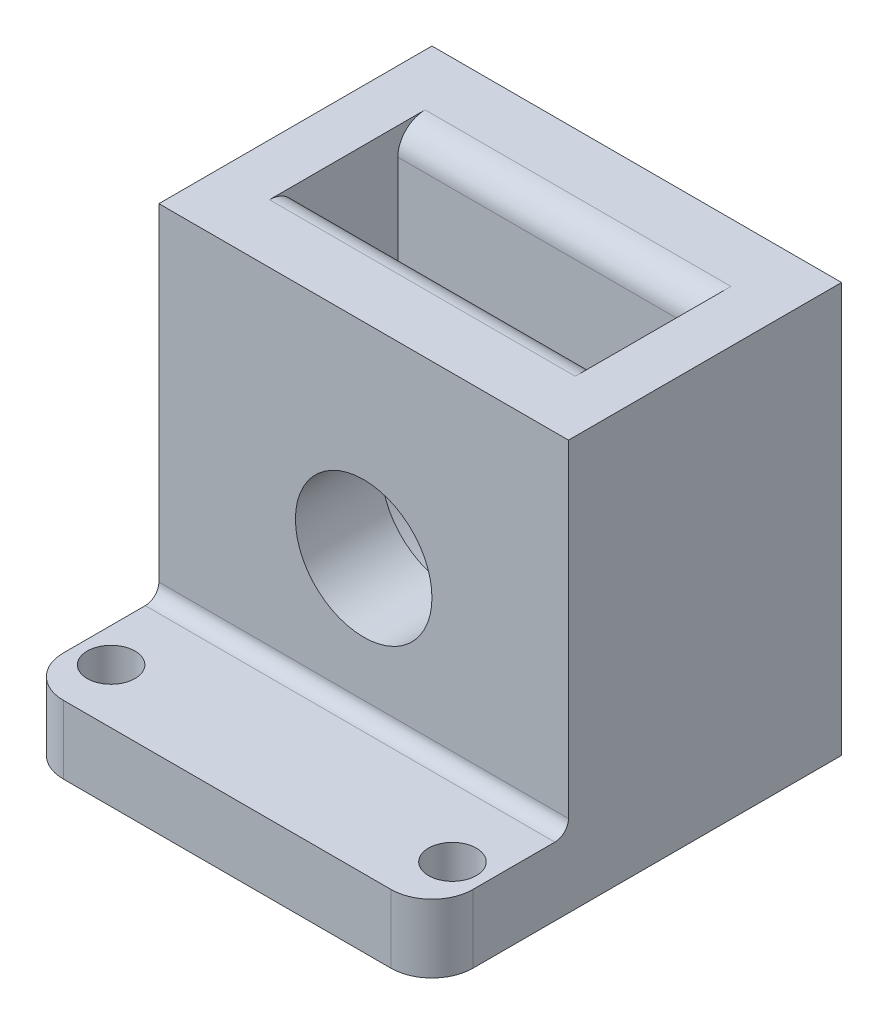
ISO-10303-21;
HEADER;
FILE_DESCRIPTION(('STEP AP214'),'2;1');
FILE_NAME('part.step','',(''),(''),'','','');
FILE_SCHEMA(('AUTOMOTIVE_DESIGN { 1 0 10303 214 1 1 1 1 }'));
ENDSEC;
DATA;
#1=APPLICATION_CONTEXT('core data for automotive mechanical design processes');
#2=APPLICATION_PROTOCOL_DEFINITION('international standard','automotive_design',2000,#1);
#3=PRODUCT_CONTEXT('',#1,'mechanical');
#4=PRODUCT('Part','Part','',(#3));
#5=PRODUCT_RELATED_PRODUCT_CATEGORY('part','',(#4));
#6=PRODUCT_DEFINITION_FORMATION('','',#4);
#7=PRODUCT_DEFINITION_CONTEXT('part definition',#1,'design');
#8=PRODUCT_DEFINITION('design','',#6,#7);
#9=PRODUCT_DEFINITION_SHAPE('','',#8);
#10=(LENGTH_UNIT() NAMED_UNIT(*) SI_UNIT(.MILLI.,.METRE.));
#11=(NAMED_UNIT(*) PLANE_ANGLE_UNIT() SI_UNIT($,.RADIAN.));
#12=(NAMED_UNIT(*) SI_UNIT($,.STERADIAN.) SOLID_ANGLE_UNIT());
#13=UNCERTAINTY_MEASURE_WITH_UNIT(LENGTH_MEASURE(1.E-05),#10,'distance_accuracy_value','');
#14=(GEOMETRIC_REPRESENTATION_CONTEXT(3) GLOBAL_UNCERTAINTY_ASSIGNED_CONTEXT((#13)) GLOBAL_UNIT_ASSIGNED_CONTEXT((#10,
#11,#12)) REPRESENTATION_CONTEXT('',''));
#15=CARTESIAN_POINT('',(0.,0.,0.));
#16=DIRECTION('',(0.,0.,1.));
#17=DIRECTION('',(1.,0.,0.));
#18=AXIS2_PLACEMENT_3D('',#15,#16,#17);
#19=CARTESIAN_POINT('',(-15.,15.,20.));
#20=DIRECTION('',(0.,-1.,0.));
#21=DIRECTION('',(0.,0.,-1.));
#22=AXIS2_PLACEMENT_3D('',#19,#20,#21);
#23=PLANE('',#22);
#24=DIRECTION('',(-1.,0.,0.));
#25=VECTOR('',#24,1.);
#26=CARTESIAN_POINT('',(-15.,15.,0.));
#27=LINE('',#26,#25);
#28=CARTESIAN_POINT('',(15.,15.,0.));
#29=VERTEX_POINT('',#28);
#30=CARTESIAN_POINT('',(-15.,15.,0.));
#31=VERTEX_POINT('',#30);
#32=EDGE_CURVE('E226',#29,#31,#27,.T.);
#33=ORIENTED_EDGE('',*,*,#32,.T.);
#34=DIRECTION('',(0.,0.,-1.));
#35=VECTOR('',#34,1.);
#36=CARTESIAN_POINT('',(-15.,15.,20.));
#37=LINE('',#36,#35);
#38=CARTESIAN_POINT('',(-15.,15.,20.));
#39=VERTEX_POINT('',#38);
#40=EDGE_CURVE('E241',#39,#31,#37,.T.);
#41=ORIENTED_EDGE('',*,*,#40,.F.);
#42=DIRECTION('',(-1.,0.,0.));
#43=VECTOR('',#42,1.);
#44=CARTESIAN_POINT('',(-15.,15.,20.));
#45=LINE('',#44,#43);
#46=CARTESIAN_POINT('',(15.,15.,20.));
#47=VERTEX_POINT('',#46);
#48=EDGE_CURVE('E214',#47,#39,#45,.T.);
#49=ORIENTED_EDGE('',*,*,#48,.F.);
#50=DIRECTION('',(0.,0.,-1.));
#51=VECTOR('',#50,1.);
#52=CARTESIAN_POINT('',(15.,15.,20.));
#53=LINE('',#52,#51);
#54=EDGE_CURVE('E245',#47,#29,#53,.T.);
#55=ORIENTED_EDGE('',*,*,#54,.T.);
#56=EDGE_LOOP('',(#33,#41,#49,#55));
#57=FACE_BOUND('',#56,.T.);
#58=DIRECTION('',(-1.,0.,0.));
#59=VECTOR('',#58,1.);
#60=CARTESIAN_POINT('',(-11.1999999999508,15.,15.7));
#61=LINE('',#60,#59);
#62=CARTESIAN_POINT('',(11.1999999999739,14.9999999999864,15.7));
#63=VERTEX_POINT('',#62);
#64=CARTESIAN_POINT('',(-11.1999999999508,15.,15.7));
#65=VERTEX_POINT('',#64);
#66=EDGE_CURVE('E299',#63,#65,#61,.T.);
#67=ORIENTED_EDGE('',*,*,#66,.T.);
#68=DIRECTION('',(0.,0.,-1.));
#69=VECTOR('',#68,1.);
#70=CARTESIAN_POINT('',(-11.1999999999508,14.9999999999864,13.7));
#71=LINE('',#70,#69);
#72=CARTESIAN_POINT('',(-11.1999999999508,15.,4.3));
#73=VERTEX_POINT('',#72);
#74=EDGE_CURVE('E174',#65,#73,#71,.T.);
#75=ORIENTED_EDGE('',*,*,#74,.T.);
#76=DIRECTION('',(-1.,0.,0.));
#77=VECTOR('',#76,1.);
#78=CARTESIAN_POINT('',(-15.,15.,4.3));
#79=LINE('',#78,#77);
#80=CARTESIAN_POINT('',(11.1999999999739,14.9999999999864,4.3));
#81=VERTEX_POINT('',#80);
#82=EDGE_CURVE('E295',#73,#81,#79,.F.);
#83=ORIENTED_EDGE('',*,*,#82,.T.);
#84=DIRECTION('',(0.,0.,-1.));
#85=VECTOR('',#84,1.);
#86=CARTESIAN_POINT('',(11.1999999999739,14.9999999999864,13.7));
#87=LINE('',#86,#85);
#88=EDGE_CURVE('E197',#63,#81,#87,.T.);
#89=ORIENTED_EDGE('',*,*,#88,.F.);
#90=EDGE_LOOP('',(#67,#75,#83,#89));
#91=FACE_BOUND('',#90,.T.);
#92=ADVANCED_FACE('F45',(#57,#91),#23,.F.);
#93=CARTESIAN_POINT('',(0.,0.,20.));
#94=DIRECTION('',(0.,0.,-1.));
#95=DIRECTION('',(-1.,0.,0.));
#96=AXIS2_PLACEMENT_3D('',#93,#94,#95);
#97=CYLINDRICAL_SURFACE('',#96,5.);
#98=CARTESIAN_POINT('',(0.,0.,20.));
#99=DIRECTION('',(0.,0.,1.));
#100=DIRECTION('',(1.,0.,0.));
#101=AXIS2_PLACEMENT_3D('',#98,#99,#100);
#102=CIRCLE('',#101,5.);
#103=CARTESIAN_POINT('',(5.,0.,20.));
#104=VERTEX_POINT('',#103);
#105=EDGE_CURVE('E201',#104,#104,#102,.T.);
#106=ORIENTED_EDGE('',*,*,#105,.T.);
#107=EDGE_LOOP('',(#106));
#108=FACE_BOUND('',#107,.T.);
#109=CARTESIAN_POINT('',(0.,0.,13.7));
#110=DIRECTION('',(0.,0.,-1.));
#111=DIRECTION('',(-1.,0.,0.));
#112=AXIS2_PLACEMENT_3D('',#109,#110,#111);
#113=CIRCLE('',#112,5.);
#114=CARTESIAN_POINT('',(-5.,0.,13.7));
#115=VERTEX_POINT('',#114);
#116=EDGE_CURVE('E210',#115,#115,#113,.T.);
#117=ORIENTED_EDGE('',*,*,#116,.T.);
#118=EDGE_LOOP('',(#117));
#119=FACE_BOUND('',#118,.T.);
#120=ADVANCED_FACE('F385',(#108,#119),#97,.F.);
#121=CARTESIAN_POINT('',(0.,0.,20.));
#122=DIRECTION('',(0.,0.,-1.));
#123=DIRECTION('',(-1.,0.,0.));
#124=AXIS2_PLACEMENT_3D('',#121,#122,#123);
#125=PLANE('',#124);
#126=DIRECTION('',(0.,-1.,0.));
#127=VECTOR('',#126,1.);
#128=CARTESIAN_POINT('',(-15.,-15.,20.));
#129=LINE('',#128,#127);
#130=CARTESIAN_POINT('',(-15.,-9.,20.));
#131=VERTEX_POINT('',#130);
#132=EDGE_CURVE('E218',#39,#131,#129,.T.);
#133=ORIENTED_EDGE('',*,*,#132,.T.);
#134=DIRECTION('',(1.,0.,0.));
#135=VECTOR('',#134,1.);
#136=CARTESIAN_POINT('',(15.,-9.,20.));
#137=LINE('',#136,#135);
#138=CARTESIAN_POINT('',(15.,-9.,20.));
#139=VERTEX_POINT('',#138);
#140=EDGE_CURVE('E282',#131,#139,#137,.T.);
#141=ORIENTED_EDGE('',*,*,#140,.T.);
#142=DIRECTION('',(0.,1.,0.));
#143=VECTOR('',#142,1.);
#144=CARTESIAN_POINT('',(15.,-15.,20.));
#145=LINE('',#144,#143);
#146=EDGE_CURVE('E211',#139,#47,#145,.T.);
#147=ORIENTED_EDGE('',*,*,#146,.T.);
#148=ORIENTED_EDGE('',*,*,#48,.T.);
#149=EDGE_LOOP('',(#133,#141,#147,#148));
#150=FACE_BOUND('',#149,.T.);
#151=ORIENTED_EDGE('',*,*,#105,.F.);
#152=EDGE_LOOP('',(#151));
#153=FACE_BOUND('',#152,.T.);
#154=ADVANCED_FACE('F393',(#150,#153),#125,.F.);
#155=CARTESIAN_POINT('',(0.,0.,0.));
#156=DIRECTION('',(0.,0.,-1.));
#157=DIRECTION('',(-1.,0.,0.));
#158=AXIS2_PLACEMENT_3D('',#155,#156,#157);
#159=PLANE('',#158);
#160=DIRECTION('',(0.,1.,0.));
#161=VECTOR('',#160,1.);
#162=CARTESIAN_POINT('',(15.,-15.,0.));
#163=LINE('',#162,#161);
#164=CARTESIAN_POINT('',(15.,-15.,0.));
#165=VERTEX_POINT('',#164);
#166=EDGE_CURVE('E205',#165,#29,#163,.T.);
#167=ORIENTED_EDGE('',*,*,#166,.F.);
#168=DIRECTION('',(1.,0.,0.));
#169=VECTOR('',#168,1.);
#170=CARTESIAN_POINT('',(-15.,-15.,0.));
#171=LINE('',#170,#169);
#172=CARTESIAN_POINT('',(-15.,-15.,0.));
#173=VERTEX_POINT('',#172);
#174=EDGE_CURVE('E215',#173,#165,#171,.T.);
#175=ORIENTED_EDGE('',*,*,#174,.F.);
#176=DIRECTION('',(0.,-1.,0.));
#177=VECTOR('',#176,1.);
#178=CARTESIAN_POINT('',(-15.,-15.,0.));
#179=LINE('',#178,#177);
#180=EDGE_CURVE('E229',#31,#173,#179,.T.);
#181=ORIENTED_EDGE('',*,*,#180,.F.);
#182=ORIENTED_EDGE('',*,*,#32,.F.);
#183=EDGE_LOOP('',(#167,#175,#181,#182));
#184=FACE_BOUND('',#183,.T.);
#185=CARTESIAN_POINT('',(0.,0.,0.));
#186=DIRECTION('',(0.,0.,1.));
#187=DIRECTION('',(1.,0.,0.));
#188=AXIS2_PLACEMENT_3D('',#185,#186,#187);
#189=CIRCLE('',#188,5.);
#190=CARTESIAN_POINT('',(5.,0.,0.));
#191=VERTEX_POINT('',#190);
#192=EDGE_CURVE('E206',#191,#191,#189,.T.);
#193=ORIENTED_EDGE('',*,*,#192,.T.);
#194=EDGE_LOOP('',(#193));
#195=FACE_BOUND('',#194,.T.);
#196=ADVANCED_FACE('F401',(#184,#195),#159,.T.);
#197=CARTESIAN_POINT('',(15.,-15.,20.));
#198=DIRECTION('',(-1.,0.,0.));
#199=DIRECTION('',(0.,0.,1.));
#200=AXIS2_PLACEMENT_3D('',#197,#198,#199);
#201=PLANE('',#200);
#202=ORIENTED_EDGE('',*,*,#146,.F.);
#203=CARTESIAN_POINT('',(15.,-9.,21.));
#204=DIRECTION('',(-1.,0.,0.));
#205=DIRECTION('',(0.,0.,1.));
#206=AXIS2_PLACEMENT_3D('',#203,#204,#205);
#207=CIRCLE('',#206,1.);
#208=CARTESIAN_POINT('',(15.,-10.,21.));
#209=VERTEX_POINT('',#208);
#210=EDGE_CURVE('E289',#139,#209,#207,.T.);
#211=ORIENTED_EDGE('',*,*,#210,.T.);
#212=DIRECTION('',(0.,0.,1.));
#213=VECTOR('',#212,1.);
#214=CARTESIAN_POINT('',(15.,-10.,20.));
#215=LINE('',#214,#213);
#216=CARTESIAN_POINT('',(15.,-10.,27.));
#217=VERTEX_POINT('',#216);
#218=EDGE_CURVE('E327',#209,#217,#215,.T.);
#219=ORIENTED_EDGE('',*,*,#218,.T.);
#220=DIRECTION('',(0.,-1.,0.));
#221=VECTOR('',#220,1.);
#222=CARTESIAN_POINT('',(15.,-15.,27.));
#223=LINE('',#222,#221);
#224=CARTESIAN_POINT('',(15.,-15.,27.));
#225=VERTEX_POINT('',#224);
#226=EDGE_CURVE('E249',#217,#225,#223,.T.);
#227=ORIENTED_EDGE('',*,*,#226,.T.);
#228=DIRECTION('',(0.,0.,-1.));
#229=VECTOR('',#228,1.);
#230=CARTESIAN_POINT('',(15.,-15.,20.));
#231=LINE('',#230,#229);
#232=EDGE_CURVE('E222',#225,#165,#231,.T.);
#233=ORIENTED_EDGE('',*,*,#232,.T.);
#234=ORIENTED_EDGE('',*,*,#166,.T.);
#235=ORIENTED_EDGE('',*,*,#54,.F.);
#236=EDGE_LOOP('',(#202,#211,#219,#227,#233,#234,#235));
#237=FACE_BOUND('',#236,.T.);
#238=ADVANCED_FACE('F398',(#237),#201,.F.);
#239=CARTESIAN_POINT('',(-15.,-15.,20.));
#240=DIRECTION('',(1.,0.,0.));
#241=DIRECTION('',(0.,0.,-1.));
#242=AXIS2_PLACEMENT_3D('',#239,#240,#241);
#243=PLANE('',#242);
#244=DIRECTION('',(0.,0.,-1.));
#245=VECTOR('',#244,1.);
#246=CARTESIAN_POINT('',(-15.,-15.,20.));
#247=LINE('',#246,#245);
#248=CARTESIAN_POINT('',(-15.,-15.,27.));
#249=VERTEX_POINT('',#248);
#250=EDGE_CURVE('E238',#249,#173,#247,.T.);
#251=ORIENTED_EDGE('',*,*,#250,.F.);
#252=DIRECTION('',(0.,-1.,0.));
#253=VECTOR('',#252,1.);
#254=CARTESIAN_POINT('',(-15.,-10.,27.));
#255=LINE('',#254,#253);
#256=CARTESIAN_POINT('',(-15.,-10.,27.));
#257=VERTEX_POINT('',#256);
#258=EDGE_CURVE('E279',#249,#257,#255,.F.);
#259=ORIENTED_EDGE('',*,*,#258,.T.);
#260=DIRECTION('',(0.,0.,-1.));
#261=VECTOR('',#260,1.);
#262=CARTESIAN_POINT('',(-15.,-10.,20.));
#263=LINE('',#262,#261);
#264=CARTESIAN_POINT('',(-15.,-10.,21.));
#265=VERTEX_POINT('',#264);
#266=EDGE_CURVE('E190',#257,#265,#263,.T.);
#267=ORIENTED_EDGE('',*,*,#266,.T.);
#268=CARTESIAN_POINT('',(-15.,-9.,21.));
#269=DIRECTION('',(1.,0.,0.));
#270=DIRECTION('',(0.,0.,-1.));
#271=AXIS2_PLACEMENT_3D('',#268,#269,#270);
#272=CIRCLE('',#271,1.);
#273=EDGE_CURVE('E292',#265,#131,#272,.T.);
#274=ORIENTED_EDGE('',*,*,#273,.T.);
#275=ORIENTED_EDGE('',*,*,#132,.F.);
#276=ORIENTED_EDGE('',*,*,#40,.T.);
#277=ORIENTED_EDGE('',*,*,#180,.T.);
#278=EDGE_LOOP('',(#251,#259,#267,#274,#275,#276,#277));
#279=FACE_BOUND('',#278,.T.);
#280=ADVANCED_FACE('F369',(#279),#243,.F.);
#281=CARTESIAN_POINT('',(-15.,-15.,20.));
#282=DIRECTION('',(0.,1.,0.));
#283=DIRECTION('',(0.,0.,1.));
#284=AXIS2_PLACEMENT_3D('',#281,#282,#283);
#285=PLANE('',#284);
#286=ORIENTED_EDGE('',*,*,#232,.F.);
#287=CARTESIAN_POINT('',(12.,-15.,27.));
#288=DIRECTION('',(0.,1.,0.));
#289=DIRECTION('',(0.,0.,1.));
#290=AXIS2_PLACEMENT_3D('',#287,#288,#289);
#291=CIRCLE('',#290,3.);
#292=CARTESIAN_POINT('',(12.,-15.,30.));
#293=VERTEX_POINT('',#292);
#294=EDGE_CURVE('E262',#225,#293,#291,.F.);
#295=ORIENTED_EDGE('',*,*,#294,.T.);
#296=DIRECTION('',(-1.,0.,0.));
#297=VECTOR('',#296,1.);
#298=CARTESIAN_POINT('',(-15.,-15.,30.));
#299=LINE('',#298,#297);
#300=CARTESIAN_POINT('',(-12.,-15.,30.));
#301=VERTEX_POINT('',#300);
#302=EDGE_CURVE('E323',#293,#301,#299,.T.);
#303=ORIENTED_EDGE('',*,*,#302,.T.);
#304=CARTESIAN_POINT('',(-12.,-15.,27.));
#305=DIRECTION('',(0.,1.,0.));
#306=DIRECTION('',(0.,0.,1.));
#307=AXIS2_PLACEMENT_3D('',#304,#305,#306);
#308=CIRCLE('',#307,3.);
#309=EDGE_CURVE('E259',#301,#249,#308,.F.);
#310=ORIENTED_EDGE('',*,*,#309,.T.);
#311=ORIENTED_EDGE('',*,*,#250,.T.);
#312=ORIENTED_EDGE('',*,*,#174,.T.);
#313=EDGE_LOOP('',(#286,#295,#303,#310,#311,#312));
#314=FACE_BOUND('',#313,.T.);
#315=CARTESIAN_POINT('',(12.5,-15.,26.));
#316=DIRECTION('',(0.,-1.,0.));
#317=DIRECTION('',(0.,0.,-1.));
#318=AXIS2_PLACEMENT_3D('',#315,#316,#317);
#319=CIRCLE('',#318,1.75);
#320=CARTESIAN_POINT('',(12.5,-15.,24.25));
#321=VERTEX_POINT('',#320);
#322=EDGE_CURVE('E346',#321,#321,#319,.T.);
#323=ORIENTED_EDGE('',*,*,#322,.F.);
#324=EDGE_LOOP('',(#323));
#325=FACE_BOUND('',#324,.T.);
#326=CARTESIAN_POINT('',(-12.5,-15.,26.));
#327=DIRECTION('',(0.,-1.,0.));
#328=DIRECTION('',(0.,0.,-1.));
#329=AXIS2_PLACEMENT_3D('',#326,#327,#328);
#330=CIRCLE('',#329,1.75);
#331=CARTESIAN_POINT('',(-12.5,-15.,24.25));
#332=VERTEX_POINT('',#331);
#333=EDGE_CURVE('E338',#332,#332,#330,.T.);
#334=ORIENTED_EDGE('',*,*,#333,.F.);
#335=EDGE_LOOP('',(#334));
#336=FACE_BOUND('',#335,.T.);
#337=ADVANCED_FACE('F365',(#314,#325,#336),#285,.F.);
#338=CARTESIAN_POINT('',(0.,0.,6.3));
#339=DIRECTION('',(0.,0.,-1.));
#340=DIRECTION('',(-1.,0.,0.));
#341=AXIS2_PLACEMENT_3D('',#338,#339,#340);
#342=CIRCLE('',#341,5.);
#343=CARTESIAN_POINT('',(-5.,0.,6.3));
#344=VERTEX_POINT('',#343);
#345=EDGE_CURVE('E200',#344,#344,#342,.T.);
#346=ORIENTED_EDGE('',*,*,#345,.F.);
#347=EDGE_LOOP('',(#346));
#348=FACE_BOUND('',#347,.T.);
#349=ORIENTED_EDGE('',*,*,#192,.F.);
#350=EDGE_LOOP('',(#349));
#351=FACE_BOUND('',#350,.T.);
#352=ADVANCED_FACE('F368',(#348,#351),#97,.F.);
#353=CARTESIAN_POINT('',(11.1999999999171,-291580.75,13.7));
#354=DIRECTION('',(-1.,0.,0.));
#355=DIRECTION('',(0.,-1.,0.));
#356=AXIS2_PLACEMENT_3D('',#353,#354,#355);
#357=PLANE('',#356);
#358=DIRECTION('',(0.,1.,0.));
#359=VECTOR('',#358,1.);
#360=CARTESIAN_POINT('',(11.1999999999171,-291580.75,6.3));
#361=LINE('',#360,#359);
#362=CARTESIAN_POINT('',(11.2,0.,6.3));
#363=VERTEX_POINT('',#362);
#364=CARTESIAN_POINT('',(11.1999999999508,12.9999999999768,6.3));
#365=VERTEX_POINT('',#364);
#366=EDGE_CURVE('E186',#363,#365,#361,.T.);
#367=ORIENTED_EDGE('',*,*,#366,.F.);
#368=DIRECTION('',(0.,0.,-1.));
#369=VECTOR('',#368,1.);
#370=CARTESIAN_POINT('',(11.2,0.,13.7));
#371=LINE('',#370,#369);
#372=CARTESIAN_POINT('',(11.2,0.,13.7));
#373=VERTEX_POINT('',#372);
#374=EDGE_CURVE('E175',#373,#363,#371,.T.);
#375=ORIENTED_EDGE('',*,*,#374,.F.);
#376=DIRECTION('',(0.,1.,0.));
#377=VECTOR('',#376,1.);
#378=CARTESIAN_POINT('',(11.1999999999171,-291580.75,13.7));
#379=LINE('',#378,#377);
#380=CARTESIAN_POINT('',(11.1999999999508,12.9999999999768,13.7));
#381=VERTEX_POINT('',#380);
#382=EDGE_CURVE('E166',#373,#381,#379,.T.);
#383=ORIENTED_EDGE('',*,*,#382,.T.);
#384=CARTESIAN_POINT('',(11.1999999999508,13.,15.7));
#385=DIRECTION('',(-1.,0.,0.));
#386=DIRECTION('',(0.,-1.,0.));
#387=AXIS2_PLACEMENT_3D('',#384,#385,#386);
#388=CIRCLE('',#387,2.);
#389=EDGE_CURVE('E311',#381,#63,#388,.F.);
#390=ORIENTED_EDGE('',*,*,#389,.T.);
#391=ORIENTED_EDGE('',*,*,#88,.T.);
#392=CARTESIAN_POINT('',(11.1999999999508,13.,4.3));
#393=DIRECTION('',(-1.,0.,0.));
#394=DIRECTION('',(0.,-1.,0.));
#395=AXIS2_PLACEMENT_3D('',#392,#393,#394);
#396=CIRCLE('',#395,2.);
#397=EDGE_CURVE('E11',#81,#365,#396,.F.);
#398=ORIENTED_EDGE('',*,*,#397,.T.);
#399=EDGE_LOOP('',(#367,#375,#383,#390,#391,#398));
#400=FACE_BOUND('',#399,.T.);
#401=ADVANCED_FACE('F320',(#400),#357,.T.);
#402=CARTESIAN_POINT('',(-11.1999999999171,-291580.75,13.7));
#403=DIRECTION('',(1.,0.,0.));
#404=DIRECTION('',(0.,1.,0.));
#405=AXIS2_PLACEMENT_3D('',#402,#403,#404);
#406=PLANE('',#405);
#407=DIRECTION('',(0.,-1.,0.));
#408=VECTOR('',#407,1.);
#409=CARTESIAN_POINT('',(-11.1999999999171,-291580.75,6.3));
#410=LINE('',#409,#408);
#411=CARTESIAN_POINT('',(-11.1999999999508,12.9999999999768,6.3));
#412=VERTEX_POINT('',#411);
#413=CARTESIAN_POINT('',(-11.2,0.,6.3));
#414=VERTEX_POINT('',#413);
#415=EDGE_CURVE('E189',#412,#414,#410,.T.);
#416=ORIENTED_EDGE('',*,*,#415,.F.);
#417=CARTESIAN_POINT('',(-11.1999999999508,13.,4.3));
#418=DIRECTION('',(1.,0.,0.));
#419=DIRECTION('',(0.,1.,0.));
#420=AXIS2_PLACEMENT_3D('',#417,#418,#419);
#421=CIRCLE('',#420,2.);
#422=EDGE_CURVE('E54',#412,#73,#421,.F.);
#423=ORIENTED_EDGE('',*,*,#422,.T.);
#424=ORIENTED_EDGE('',*,*,#74,.F.);
#425=CARTESIAN_POINT('',(-11.1999999999508,13.,15.7));
#426=DIRECTION('',(1.,0.,0.));
#427=DIRECTION('',(0.,1.,0.));
#428=AXIS2_PLACEMENT_3D('',#425,#426,#427);
#429=CIRCLE('',#428,2.);
#430=CARTESIAN_POINT('',(-11.1999999999508,12.9999999999768,13.7));
#431=VERTEX_POINT('',#430);
#432=EDGE_CURVE('E160',#65,#431,#429,.F.);
#433=ORIENTED_EDGE('',*,*,#432,.T.);
#434=DIRECTION('',(0.,-1.,0.));
#435=VECTOR('',#434,1.);
#436=CARTESIAN_POINT('',(-11.1999999999171,-291580.75,13.7));
#437=LINE('',#436,#435);
#438=CARTESIAN_POINT('',(-11.2,0.,13.7));
#439=VERTEX_POINT('',#438);
#440=EDGE_CURVE('E153',#431,#439,#437,.T.);
#441=ORIENTED_EDGE('',*,*,#440,.T.);
#442=DIRECTION('',(0.,0.,-1.));
#443=VECTOR('',#442,1.);
#444=CARTESIAN_POINT('',(-11.2,0.,13.7));
#445=LINE('',#444,#443);
#446=EDGE_CURVE('E157',#439,#414,#445,.T.);
#447=ORIENTED_EDGE('',*,*,#446,.T.);
#448=EDGE_LOOP('',(#416,#423,#424,#433,#441,#447));
#449=FACE_BOUND('',#448,.T.);
#450=ADVANCED_FACE('F156',(#449),#406,.T.);
#451=CARTESIAN_POINT('',(0.,0.,13.7));
#452=DIRECTION('',(0.,0.,-1.));
#453=DIRECTION('',(-1.,0.,0.));
#454=AXIS2_PLACEMENT_3D('',#451,#452,#453);
#455=CYLINDRICAL_SURFACE('',#454,11.2);
#456=CARTESIAN_POINT('',(0.,0.,6.3));
#457=DIRECTION('',(0.,0.,-1.));
#458=DIRECTION('',(-1.,0.,0.));
#459=AXIS2_PLACEMENT_3D('',#456,#457,#458);
#460=CIRCLE('',#459,11.2);
#461=EDGE_CURVE('E172',#363,#414,#460,.T.);
#462=ORIENTED_EDGE('',*,*,#461,.T.);
#463=ORIENTED_EDGE('',*,*,#446,.F.);
#464=CARTESIAN_POINT('',(0.,0.,13.7));
#465=DIRECTION('',(0.,0.,-1.));
#466=DIRECTION('',(-1.,0.,0.));
#467=AXIS2_PLACEMENT_3D('',#464,#465,#466);
#468=CIRCLE('',#467,11.2);
#469=EDGE_CURVE('E165',#373,#439,#468,.T.);
#470=ORIENTED_EDGE('',*,*,#469,.F.);
#471=ORIENTED_EDGE('',*,*,#374,.T.);
#472=EDGE_LOOP('',(#462,#463,#470,#471));
#473=FACE_BOUND('',#472,.T.);
#474=ADVANCED_FACE('F170',(#473),#455,.F.);
#475=CARTESIAN_POINT('',(0.,0.,13.7));
#476=DIRECTION('',(0.,0.,-1.));
#477=DIRECTION('',(-1.,0.,0.));
#478=AXIS2_PLACEMENT_3D('',#475,#476,#477);
#479=PLANE('',#478);
#480=ORIENTED_EDGE('',*,*,#116,.F.);
#481=EDGE_LOOP('',(#480));
#482=FACE_BOUND('',#481,.T.);
#483=ORIENTED_EDGE('',*,*,#440,.F.);
#484=DIRECTION('',(-1.,0.,0.));
#485=VECTOR('',#484,1.);
#486=CARTESIAN_POINT('',(11.1999999999739,13.,13.7));
#487=LINE('',#486,#485);
#488=EDGE_CURVE('E303',#431,#381,#487,.F.);
#489=ORIENTED_EDGE('',*,*,#488,.T.);
#490=ORIENTED_EDGE('',*,*,#382,.F.);
#491=ORIENTED_EDGE('',*,*,#469,.T.);
#492=EDGE_LOOP('',(#483,#489,#490,#491));
#493=FACE_BOUND('',#492,.T.);
#494=ADVANCED_FACE('F178',(#482,#493),#479,.T.);
#495=CARTESIAN_POINT('',(0.,0.,6.3));
#496=DIRECTION('',(0.,0.,-1.));
#497=DIRECTION('',(-1.,0.,0.));
#498=AXIS2_PLACEMENT_3D('',#495,#496,#497);
#499=PLANE('',#498);
#500=ORIENTED_EDGE('',*,*,#345,.T.);
#501=EDGE_LOOP('',(#500));
#502=FACE_BOUND('',#501,.T.);
#503=ORIENTED_EDGE('',*,*,#366,.T.);
#504=DIRECTION('',(-1.,0.,0.));
#505=VECTOR('',#504,1.);
#506=CARTESIAN_POINT('',(0.,13.,6.3));
#507=LINE('',#506,#505);
#508=EDGE_CURVE('E306',#365,#412,#507,.T.);
#509=ORIENTED_EDGE('',*,*,#508,.T.);
#510=ORIENTED_EDGE('',*,*,#415,.T.);
#511=ORIENTED_EDGE('',*,*,#461,.F.);
#512=EDGE_LOOP('',(#503,#509,#510,#511));
#513=FACE_BOUND('',#512,.T.);
#514=ADVANCED_FACE('F469',(#502,#513),#499,.F.);
#515=CARTESIAN_POINT('',(-15.,-10.,30.));
#516=DIRECTION('',(0.,0.,1.));
#517=DIRECTION('',(1.,0.,0.));
#518=AXIS2_PLACEMENT_3D('',#515,#516,#517);
#519=PLANE('',#518);
#520=ORIENTED_EDGE('',*,*,#302,.F.);
#521=DIRECTION('',(0.,-1.,0.));
#522=VECTOR('',#521,1.);
#523=CARTESIAN_POINT('',(12.,-10.,30.));
#524=LINE('',#523,#522);
#525=CARTESIAN_POINT('',(12.,-10.,30.));
#526=VERTEX_POINT('',#525);
#527=EDGE_CURVE('E269',#293,#526,#524,.F.);
#528=ORIENTED_EDGE('',*,*,#527,.T.);
#529=DIRECTION('',(-1.,0.,0.));
#530=VECTOR('',#529,1.);
#531=CARTESIAN_POINT('',(-15.,-10.,30.));
#532=LINE('',#531,#530);
#533=CARTESIAN_POINT('',(-12.,-10.,30.));
#534=VERTEX_POINT('',#533);
#535=EDGE_CURVE('E332',#526,#534,#532,.T.);
#536=ORIENTED_EDGE('',*,*,#535,.T.);
#537=DIRECTION('',(0.,-1.,0.));
#538=VECTOR('',#537,1.);
#539=CARTESIAN_POINT('',(-12.,-15.,30.));
#540=LINE('',#539,#538);
#541=EDGE_CURVE('E265',#534,#301,#540,.T.);
#542=ORIENTED_EDGE('',*,*,#541,.T.);
#543=EDGE_LOOP('',(#520,#528,#536,#542));
#544=FACE_BOUND('',#543,.T.);
#545=ADVANCED_FACE('F381',(#544),#519,.T.);
#546=CARTESIAN_POINT('',(0.,-10.,0.));
#547=DIRECTION('',(0.,-1.,0.));
#548=DIRECTION('',(0.,0.,-1.));
#549=AXIS2_PLACEMENT_3D('',#546,#547,#548);
#550=PLANE('',#549);
#551=CARTESIAN_POINT('',(12.5,-10.,26.));
#552=DIRECTION('',(0.,-1.,0.));
#553=DIRECTION('',(0.,0.,-1.));
#554=AXIS2_PLACEMENT_3D('',#551,#552,#553);
#555=CIRCLE('',#554,1.75);
#556=CARTESIAN_POINT('',(12.5,-10.,24.25));
#557=VERTEX_POINT('',#556);
#558=EDGE_CURVE('E342',#557,#557,#555,.T.);
#559=ORIENTED_EDGE('',*,*,#558,.T.);
#560=EDGE_LOOP('',(#559));
#561=FACE_BOUND('',#560,.T.);
#562=CARTESIAN_POINT('',(-12.5,-10.,26.));
#563=DIRECTION('',(0.,-1.,0.));
#564=DIRECTION('',(0.,0.,-1.));
#565=AXIS2_PLACEMENT_3D('',#562,#563,#564);
#566=CIRCLE('',#565,1.75);
#567=CARTESIAN_POINT('',(-12.5,-10.,24.25));
#568=VERTEX_POINT('',#567);
#569=EDGE_CURVE('E328',#568,#568,#566,.T.);
#570=ORIENTED_EDGE('',*,*,#569,.T.);
#571=EDGE_LOOP('',(#570));
#572=FACE_BOUND('',#571,.T.);
#573=ORIENTED_EDGE('',*,*,#218,.F.);
#574=DIRECTION('',(1.,0.,0.));
#575=VECTOR('',#574,1.);
#576=CARTESIAN_POINT('',(-15.,-10.,21.));
#577=LINE('',#576,#575);
#578=EDGE_CURVE('E286',#209,#265,#577,.F.);
#579=ORIENTED_EDGE('',*,*,#578,.T.);
#580=ORIENTED_EDGE('',*,*,#266,.F.);
#581=CARTESIAN_POINT('',(-12.,-10.,27.));
#582=DIRECTION('',(0.,-1.,0.));
#583=DIRECTION('',(0.,0.,-1.));
#584=AXIS2_PLACEMENT_3D('',#581,#582,#583);
#585=CIRCLE('',#584,3.);
#586=EDGE_CURVE('E272',#257,#534,#585,.F.);
#587=ORIENTED_EDGE('',*,*,#586,.T.);
#588=ORIENTED_EDGE('',*,*,#535,.F.);
#589=CARTESIAN_POINT('',(12.,-10.,27.));
#590=DIRECTION('',(0.,-1.,0.));
#591=DIRECTION('',(0.,0.,-1.));
#592=AXIS2_PLACEMENT_3D('',#589,#590,#591);
#593=CIRCLE('',#592,3.);
#594=EDGE_CURVE('E275',#526,#217,#593,.F.);
#595=ORIENTED_EDGE('',*,*,#594,.T.);
#596=EDGE_LOOP('',(#573,#579,#580,#587,#588,#595));
#597=FACE_BOUND('',#596,.T.);
#598=ADVANCED_FACE('F354',(#561,#572,#597),#550,.F.);
#599=CARTESIAN_POINT('',(-12.5,-10.,26.));
#600=DIRECTION('',(0.,-1.,0.));
#601=DIRECTION('',(0.,0.,-1.));
#602=AXIS2_PLACEMENT_3D('',#599,#600,#601);
#603=CYLINDRICAL_SURFACE('',#602,1.75);
#604=ORIENTED_EDGE('',*,*,#569,.F.);
#605=EDGE_LOOP('',(#604));
#606=FACE_BOUND('',#605,.T.);
#607=ORIENTED_EDGE('',*,*,#333,.T.);
#608=EDGE_LOOP('',(#607));
#609=FACE_BOUND('',#608,.T.);
#610=ADVANCED_FACE('F361',(#606,#609),#603,.F.);
#611=CARTESIAN_POINT('',(12.5,-10.,26.));
#612=DIRECTION('',(0.,-1.,0.));
#613=DIRECTION('',(0.,0.,-1.));
#614=AXIS2_PLACEMENT_3D('',#611,#612,#613);
#615=CYLINDRICAL_SURFACE('',#614,1.75);
#616=ORIENTED_EDGE('',*,*,#558,.F.);
#617=EDGE_LOOP('',(#616));
#618=FACE_BOUND('',#617,.T.);
#619=ORIENTED_EDGE('',*,*,#322,.T.);
#620=EDGE_LOOP('',(#619));
#621=FACE_BOUND('',#620,.T.);
#622=ADVANCED_FACE('F357',(#618,#621),#615,.F.);
#623=CARTESIAN_POINT('',(12.,-15.,27.));
#624=DIRECTION('',(0.,1.,0.));
#625=DIRECTION('',(0.,0.,1.));
#626=AXIS2_PLACEMENT_3D('',#623,#624,#625);
#627=CYLINDRICAL_SURFACE('',#626,3.);
#628=ORIENTED_EDGE('',*,*,#594,.F.);
#629=ORIENTED_EDGE('',*,*,#527,.F.);
#630=ORIENTED_EDGE('',*,*,#294,.F.);
#631=ORIENTED_EDGE('',*,*,#226,.F.);
#632=EDGE_LOOP('',(#628,#629,#630,#631));
#633=FACE_BOUND('',#632,.T.);
#634=ADVANCED_FACE('F360',(#633),#627,.T.);
#635=CARTESIAN_POINT('',(-12.,-10.,27.));
#636=DIRECTION('',(0.,1.,0.));
#637=DIRECTION('',(0.,0.,1.));
#638=AXIS2_PLACEMENT_3D('',#635,#636,#637);
#639=CYLINDRICAL_SURFACE('',#638,3.);
#640=ORIENTED_EDGE('',*,*,#586,.F.);
#641=ORIENTED_EDGE('',*,*,#258,.F.);
#642=ORIENTED_EDGE('',*,*,#309,.F.);
#643=ORIENTED_EDGE('',*,*,#541,.F.);
#644=EDGE_LOOP('',(#640,#641,#642,#643));
#645=FACE_BOUND('',#644,.T.);
#646=ADVANCED_FACE('F405',(#645),#639,.T.);
#647=CARTESIAN_POINT('',(0.,-9.,21.));
#648=DIRECTION('',(-1.,0.,0.));
#649=DIRECTION('',(0.,0.,1.));
#650=AXIS2_PLACEMENT_3D('',#647,#648,#649);
#651=CYLINDRICAL_SURFACE('',#650,1.);
#652=ORIENTED_EDGE('',*,*,#273,.F.);
#653=ORIENTED_EDGE('',*,*,#578,.F.);
#654=ORIENTED_EDGE('',*,*,#210,.F.);
#655=ORIENTED_EDGE('',*,*,#140,.F.);
#656=EDGE_LOOP('',(#652,#653,#654,#655));
#657=FACE_BOUND('',#656,.T.);
#658=ADVANCED_FACE('F409',(#657),#651,.F.);
#659=CARTESIAN_POINT('',(-15.,13.,15.7));
#660=DIRECTION('',(1.,0.,0.));
#661=DIRECTION('',(0.,0.,-1.));
#662=AXIS2_PLACEMENT_3D('',#659,#660,#661);
#663=CYLINDRICAL_SURFACE('',#662,2.);
#664=ORIENTED_EDGE('',*,*,#389,.F.);
#665=ORIENTED_EDGE('',*,*,#488,.F.);
#666=ORIENTED_EDGE('',*,*,#432,.F.);
#667=ORIENTED_EDGE('',*,*,#66,.F.);
#668=EDGE_LOOP('',(#664,#665,#666,#667));
#669=FACE_BOUND('',#668,.T.);
#670=ADVANCED_FACE('F319',(#669),#663,.T.);
#671=CARTESIAN_POINT('',(0.,13.,4.3));
#672=DIRECTION('',(-1.,0.,0.));
#673=DIRECTION('',(0.,0.,1.));
#674=AXIS2_PLACEMENT_3D('',#671,#672,#673);
#675=CYLINDRICAL_SURFACE('',#674,2.);
#676=ORIENTED_EDGE('',*,*,#397,.F.);
#677=ORIENTED_EDGE('',*,*,#82,.F.);
#678=ORIENTED_EDGE('',*,*,#422,.F.);
#679=ORIENTED_EDGE('',*,*,#508,.F.);
#680=EDGE_LOOP('',(#676,#677,#678,#679));
#681=FACE_BOUND('',#680,.T.);
#682=ADVANCED_FACE('F47',(#681),#675,.T.);
#683=CLOSED_SHELL('',(#92,#120,#154,#196,#238,#280,#337,#352,#401,#450,#474,#494,#514,#545,#598,
#610,#622,#634,#646,#658,#670,#682));
#684=MANIFOLD_SOLID_BREP('B2',#683);
#685=ADVANCED_BREP_SHAPE_REPRESENTATION('',(#18,#684),#14);
#686=SHAPE_DEFINITION_REPRESENTATION(#9,#685);
ENDSEC;
END-ISO-10303-21;
